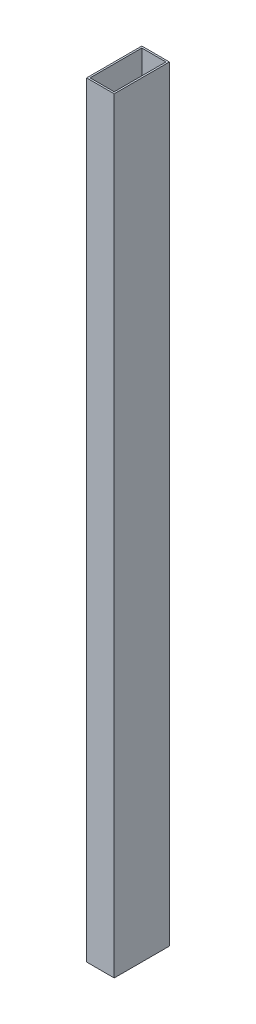
ISO-10303-21;
HEADER;
FILE_DESCRIPTION(('STEP AP214'),'2;1');
FILE_NAME('part.step','',(''),(''),'','','');
FILE_SCHEMA(('AUTOMOTIVE_DESIGN { 1 0 10303 214 1 1 1 1 }'));
ENDSEC;
DATA;
#1=APPLICATION_CONTEXT('core data for automotive mechanical design processes');
#2=APPLICATION_PROTOCOL_DEFINITION('international standard','automotive_design',2000,#1);
#3=PRODUCT_CONTEXT('',#1,'mechanical');
#4=PRODUCT('Part','Part','',(#3));
#5=PRODUCT_RELATED_PRODUCT_CATEGORY('part','',(#4));
#6=PRODUCT_DEFINITION_FORMATION('','',#4);
#7=PRODUCT_DEFINITION_CONTEXT('part definition',#1,'design');
#8=PRODUCT_DEFINITION('design','',#6,#7);
#9=PRODUCT_DEFINITION_SHAPE('','',#8);
#10=(LENGTH_UNIT() NAMED_UNIT(*) SI_UNIT(.MILLI.,.METRE.));
#11=(NAMED_UNIT(*) PLANE_ANGLE_UNIT() SI_UNIT($,.RADIAN.));
#12=(NAMED_UNIT(*) SI_UNIT($,.STERADIAN.) SOLID_ANGLE_UNIT());
#13=UNCERTAINTY_MEASURE_WITH_UNIT(LENGTH_MEASURE(1.E-05),#10,'distance_accuracy_value','');
#14=(GEOMETRIC_REPRESENTATION_CONTEXT(3) GLOBAL_UNCERTAINTY_ASSIGNED_CONTEXT((#13)) GLOBAL_UNIT_ASSIGNED_CONTEXT((#10,
#11,#12)) REPRESENTATION_CONTEXT('',''));
#15=CARTESIAN_POINT('',(0.,0.,0.));
#16=DIRECTION('',(0.,0.,1.));
#17=DIRECTION('',(1.,0.,0.));
#18=AXIS2_PLACEMENT_3D('',#15,#16,#17);
#19=CARTESIAN_POINT('',(0.,704.85,0.));
#20=DIRECTION('',(0.,1.,0.));
#21=DIRECTION('',(0.,0.,1.));
#22=AXIS2_PLACEMENT_3D('',#19,#20,#21);
#23=PLANE('',#22);
#24=DIRECTION('',(0.,0.,1.));
#25=VECTOR('',#24,1.);
#26=CARTESIAN_POINT('',(-12.7,704.85,-25.4));
#27=LINE('',#26,#25);
#28=CARTESIAN_POINT('',(-12.7,704.85,-25.4));
#29=VERTEX_POINT('',#28);
#30=CARTESIAN_POINT('',(-12.7,704.85,25.4));
#31=VERTEX_POINT('',#30);
#32=EDGE_CURVE('E176',#29,#31,#27,.T.);
#33=ORIENTED_EDGE('',*,*,#32,.T.);
#34=DIRECTION('',(1.,0.,0.));
#35=VECTOR('',#34,1.);
#36=CARTESIAN_POINT('',(12.7,704.85,25.4));
#37=LINE('',#36,#35);
#38=CARTESIAN_POINT('',(12.7,704.85,25.4));
#39=VERTEX_POINT('',#38);
#40=EDGE_CURVE('E179',#31,#39,#37,.T.);
#41=ORIENTED_EDGE('',*,*,#40,.T.);
#42=DIRECTION('',(0.,0.,-1.));
#43=VECTOR('',#42,1.);
#44=CARTESIAN_POINT('',(12.7,704.85,-25.4));
#45=LINE('',#44,#43);
#46=CARTESIAN_POINT('',(12.7,704.85,-25.4));
#47=VERTEX_POINT('',#46);
#48=EDGE_CURVE('E182',#39,#47,#45,.T.);
#49=ORIENTED_EDGE('',*,*,#48,.T.);
#50=DIRECTION('',(-1.,0.,0.));
#51=VECTOR('',#50,1.);
#52=CARTESIAN_POINT('',(12.7,704.85,-25.4));
#53=LINE('',#52,#51);
#54=EDGE_CURVE('E184',#47,#29,#53,.T.);
#55=ORIENTED_EDGE('',*,*,#54,.T.);
#56=EDGE_LOOP('',(#33,#41,#49,#55));
#57=FACE_BOUND('',#56,.T.);
#58=DIRECTION('',(1.,0.,0.));
#59=VECTOR('',#58,1.);
#60=CARTESIAN_POINT('',(0.,704.85,23.8125));
#61=LINE('',#60,#59);
#62=CARTESIAN_POINT('',(-11.1125,704.85,23.8125));
#63=VERTEX_POINT('',#62);
#64=CARTESIAN_POINT('',(11.1125,704.85,23.8125));
#65=VERTEX_POINT('',#64);
#66=EDGE_CURVE('E143',#63,#65,#61,.T.);
#67=ORIENTED_EDGE('',*,*,#66,.F.);
#68=DIRECTION('',(0.,0.,1.));
#69=VECTOR('',#68,1.);
#70=CARTESIAN_POINT('',(-11.1125,704.85,0.));
#71=LINE('',#70,#69);
#72=CARTESIAN_POINT('',(-11.1125,704.85,-23.8125));
#73=VERTEX_POINT('',#72);
#74=EDGE_CURVE('E135',#73,#63,#71,.T.);
#75=ORIENTED_EDGE('',*,*,#74,.F.);
#76=DIRECTION('',(-1.,0.,0.));
#77=VECTOR('',#76,1.);
#78=CARTESIAN_POINT('',(0.,704.85,-23.8125));
#79=LINE('',#78,#77);
#80=CARTESIAN_POINT('',(11.1125,704.85,-23.8125));
#81=VERTEX_POINT('',#80);
#82=EDGE_CURVE('E158',#81,#73,#79,.T.);
#83=ORIENTED_EDGE('',*,*,#82,.F.);
#84=DIRECTION('',(0.,0.,-1.));
#85=VECTOR('',#84,1.);
#86=CARTESIAN_POINT('',(11.1125,704.85,0.));
#87=LINE('',#86,#85);
#88=EDGE_CURVE('E156',#65,#81,#87,.T.);
#89=ORIENTED_EDGE('',*,*,#88,.F.);
#90=EDGE_LOOP('',(#67,#75,#83,#89));
#91=FACE_BOUND('',#90,.T.);
#92=ADVANCED_FACE('F69',(#57,#91),#23,.T.);
#93=CARTESIAN_POINT('',(0.,0.,0.));
#94=DIRECTION('',(0.,1.,0.));
#95=DIRECTION('',(0.,0.,1.));
#96=AXIS2_PLACEMENT_3D('',#93,#94,#95);
#97=PLANE('',#96);
#98=DIRECTION('',(0.,0.,1.));
#99=VECTOR('',#98,1.);
#100=CARTESIAN_POINT('',(-12.7,0.,-25.4));
#101=LINE('',#100,#99);
#102=CARTESIAN_POINT('',(-12.7,0.,-25.4));
#103=VERTEX_POINT('',#102);
#104=CARTESIAN_POINT('',(-12.7,0.,25.4));
#105=VERTEX_POINT('',#104);
#106=EDGE_CURVE('E152',#103,#105,#101,.T.);
#107=ORIENTED_EDGE('',*,*,#106,.F.);
#108=DIRECTION('',(-1.,0.,0.));
#109=VECTOR('',#108,1.);
#110=CARTESIAN_POINT('',(12.7,0.,-25.4));
#111=LINE('',#110,#109);
#112=CARTESIAN_POINT('',(12.7,0.,-25.4));
#113=VERTEX_POINT('',#112);
#114=EDGE_CURVE('E180',#113,#103,#111,.T.);
#115=ORIENTED_EDGE('',*,*,#114,.F.);
#116=DIRECTION('',(0.,0.,-1.));
#117=VECTOR('',#116,1.);
#118=CARTESIAN_POINT('',(12.7,0.,-25.4));
#119=LINE('',#118,#117);
#120=CARTESIAN_POINT('',(12.7,0.,25.4));
#121=VERTEX_POINT('',#120);
#122=EDGE_CURVE('E192',#121,#113,#119,.T.);
#123=ORIENTED_EDGE('',*,*,#122,.F.);
#124=DIRECTION('',(1.,0.,0.));
#125=VECTOR('',#124,1.);
#126=CARTESIAN_POINT('',(12.7,0.,25.4));
#127=LINE('',#126,#125);
#128=EDGE_CURVE('E190',#105,#121,#127,.T.);
#129=ORIENTED_EDGE('',*,*,#128,.F.);
#130=EDGE_LOOP('',(#107,#115,#123,#129));
#131=FACE_BOUND('',#130,.T.);
#132=DIRECTION('',(0.,0.,1.));
#133=VECTOR('',#132,1.);
#134=CARTESIAN_POINT('',(-11.1125,0.,0.));
#135=LINE('',#134,#133);
#136=CARTESIAN_POINT('',(-11.1125,0.,-23.8125));
#137=VERTEX_POINT('',#136);
#138=CARTESIAN_POINT('',(-11.1125,0.,23.8125));
#139=VERTEX_POINT('',#138);
#140=EDGE_CURVE('E93',#137,#139,#135,.T.);
#141=ORIENTED_EDGE('',*,*,#140,.T.);
#142=DIRECTION('',(1.,0.,0.));
#143=VECTOR('',#142,1.);
#144=CARTESIAN_POINT('',(0.,0.,23.8125));
#145=LINE('',#144,#143);
#146=CARTESIAN_POINT('',(11.1125,0.,23.8125));
#147=VERTEX_POINT('',#146);
#148=EDGE_CURVE('E150',#139,#147,#145,.T.);
#149=ORIENTED_EDGE('',*,*,#148,.T.);
#150=DIRECTION('',(0.,0.,-1.));
#151=VECTOR('',#150,1.);
#152=CARTESIAN_POINT('',(11.1125,0.,0.));
#153=LINE('',#152,#151);
#154=CARTESIAN_POINT('',(11.1125,0.,-23.8125));
#155=VERTEX_POINT('',#154);
#156=EDGE_CURVE('E165',#147,#155,#153,.T.);
#157=ORIENTED_EDGE('',*,*,#156,.T.);
#158=DIRECTION('',(-1.,0.,0.));
#159=VECTOR('',#158,1.);
#160=CARTESIAN_POINT('',(0.,0.,-23.8125));
#161=LINE('',#160,#159);
#162=EDGE_CURVE('E144',#155,#137,#161,.T.);
#163=ORIENTED_EDGE('',*,*,#162,.T.);
#164=EDGE_LOOP('',(#141,#149,#157,#163));
#165=FACE_BOUND('',#164,.T.);
#166=ADVANCED_FACE('F213',(#131,#165),#97,.F.);
#167=CARTESIAN_POINT('',(-12.7,704.85,-25.4));
#168=DIRECTION('',(1.,0.,0.));
#169=DIRECTION('',(0.,0.,-1.));
#170=AXIS2_PLACEMENT_3D('',#167,#168,#169);
#171=PLANE('',#170);
#172=ORIENTED_EDGE('',*,*,#106,.T.);
#173=DIRECTION('',(0.,-1.,0.));
#174=VECTOR('',#173,1.);
#175=CARTESIAN_POINT('',(-12.7,704.85,25.4));
#176=LINE('',#175,#174);
#177=EDGE_CURVE('E12',#31,#105,#176,.T.);
#178=ORIENTED_EDGE('',*,*,#177,.F.);
#179=ORIENTED_EDGE('',*,*,#32,.F.);
#180=DIRECTION('',(0.,-1.,0.));
#181=VECTOR('',#180,1.);
#182=CARTESIAN_POINT('',(-12.7,704.85,-25.4));
#183=LINE('',#182,#181);
#184=EDGE_CURVE('E186',#29,#103,#183,.T.);
#185=ORIENTED_EDGE('',*,*,#184,.T.);
#186=EDGE_LOOP('',(#172,#178,#179,#185));
#187=FACE_BOUND('',#186,.T.);
#188=ADVANCED_FACE('F71',(#187),#171,.F.);
#189=CARTESIAN_POINT('',(12.7,704.85,25.4));
#190=DIRECTION('',(0.,0.,-1.));
#191=DIRECTION('',(-1.,0.,0.));
#192=AXIS2_PLACEMENT_3D('',#189,#190,#191);
#193=PLANE('',#192);
#194=ORIENTED_EDGE('',*,*,#128,.T.);
#195=DIRECTION('',(0.,-1.,0.));
#196=VECTOR('',#195,1.);
#197=CARTESIAN_POINT('',(12.7,704.85,25.4));
#198=LINE('',#197,#196);
#199=EDGE_CURVE('E78',#39,#121,#198,.T.);
#200=ORIENTED_EDGE('',*,*,#199,.F.);
#201=ORIENTED_EDGE('',*,*,#40,.F.);
#202=ORIENTED_EDGE('',*,*,#177,.T.);
#203=EDGE_LOOP('',(#194,#200,#201,#202));
#204=FACE_BOUND('',#203,.T.);
#205=ADVANCED_FACE('F223',(#204),#193,.F.);
#206=CARTESIAN_POINT('',(12.7,704.85,-25.4));
#207=DIRECTION('',(-1.,0.,0.));
#208=DIRECTION('',(0.,0.,1.));
#209=AXIS2_PLACEMENT_3D('',#206,#207,#208);
#210=PLANE('',#209);
#211=ORIENTED_EDGE('',*,*,#122,.T.);
#212=DIRECTION('',(0.,-1.,0.));
#213=VECTOR('',#212,1.);
#214=CARTESIAN_POINT('',(12.7,704.85,-25.4));
#215=LINE('',#214,#213);
#216=EDGE_CURVE('E198',#47,#113,#215,.T.);
#217=ORIENTED_EDGE('',*,*,#216,.F.);
#218=ORIENTED_EDGE('',*,*,#48,.F.);
#219=ORIENTED_EDGE('',*,*,#199,.T.);
#220=EDGE_LOOP('',(#211,#217,#218,#219));
#221=FACE_BOUND('',#220,.T.);
#222=ADVANCED_FACE('F207',(#221),#210,.F.);
#223=CARTESIAN_POINT('',(12.7,704.85,-25.4));
#224=DIRECTION('',(0.,0.,1.));
#225=DIRECTION('',(1.,0.,0.));
#226=AXIS2_PLACEMENT_3D('',#223,#224,#225);
#227=PLANE('',#226);
#228=ORIENTED_EDGE('',*,*,#114,.T.);
#229=ORIENTED_EDGE('',*,*,#184,.F.);
#230=ORIENTED_EDGE('',*,*,#54,.F.);
#231=ORIENTED_EDGE('',*,*,#216,.T.);
#232=EDGE_LOOP('',(#228,#229,#230,#231));
#233=FACE_BOUND('',#232,.T.);
#234=ADVANCED_FACE('F217',(#233),#227,.F.);
#235=CARTESIAN_POINT('',(-11.1125,704.85,0.));
#236=DIRECTION('',(1.,0.,0.));
#237=DIRECTION('',(0.,0.,-1.));
#238=AXIS2_PLACEMENT_3D('',#235,#236,#237);
#239=PLANE('',#238);
#240=ORIENTED_EDGE('',*,*,#140,.F.);
#241=DIRECTION('',(0.,-1.,0.));
#242=VECTOR('',#241,1.);
#243=CARTESIAN_POINT('',(-11.1125,704.85,-23.8125));
#244=LINE('',#243,#242);
#245=EDGE_CURVE('E139',#73,#137,#244,.T.);
#246=ORIENTED_EDGE('',*,*,#245,.F.);
#247=ORIENTED_EDGE('',*,*,#74,.T.);
#248=DIRECTION('',(0.,-1.,0.));
#249=VECTOR('',#248,1.);
#250=CARTESIAN_POINT('',(-11.1125,704.85,23.8125));
#251=LINE('',#250,#249);
#252=EDGE_CURVE('E138',#63,#139,#251,.T.);
#253=ORIENTED_EDGE('',*,*,#252,.T.);
#254=EDGE_LOOP('',(#240,#246,#247,#253));
#255=FACE_BOUND('',#254,.T.);
#256=ADVANCED_FACE('F137',(#255),#239,.T.);
#257=CARTESIAN_POINT('',(0.,704.85,23.8125));
#258=DIRECTION('',(0.,0.,-1.));
#259=DIRECTION('',(-1.,0.,0.));
#260=AXIS2_PLACEMENT_3D('',#257,#258,#259);
#261=PLANE('',#260);
#262=ORIENTED_EDGE('',*,*,#148,.F.);
#263=ORIENTED_EDGE('',*,*,#252,.F.);
#264=ORIENTED_EDGE('',*,*,#66,.T.);
#265=DIRECTION('',(0.,-1.,0.));
#266=VECTOR('',#265,1.);
#267=CARTESIAN_POINT('',(11.1125,704.85,23.8125));
#268=LINE('',#267,#266);
#269=EDGE_CURVE('E153',#65,#147,#268,.T.);
#270=ORIENTED_EDGE('',*,*,#269,.T.);
#271=EDGE_LOOP('',(#262,#263,#264,#270));
#272=FACE_BOUND('',#271,.T.);
#273=ADVANCED_FACE('F147',(#272),#261,.T.);
#274=CARTESIAN_POINT('',(11.1125,704.85,0.));
#275=DIRECTION('',(-1.,0.,0.));
#276=DIRECTION('',(0.,0.,1.));
#277=AXIS2_PLACEMENT_3D('',#274,#275,#276);
#278=PLANE('',#277);
#279=ORIENTED_EDGE('',*,*,#156,.F.);
#280=ORIENTED_EDGE('',*,*,#269,.F.);
#281=ORIENTED_EDGE('',*,*,#88,.T.);
#282=DIRECTION('',(0.,-1.,0.));
#283=VECTOR('',#282,1.);
#284=CARTESIAN_POINT('',(11.1125,704.85,-23.8125));
#285=LINE('',#284,#283);
#286=EDGE_CURVE('E85',#81,#155,#285,.T.);
#287=ORIENTED_EDGE('',*,*,#286,.T.);
#288=EDGE_LOOP('',(#279,#280,#281,#287));
#289=FACE_BOUND('',#288,.T.);
#290=ADVANCED_FACE('F248',(#289),#278,.T.);
#291=CARTESIAN_POINT('',(0.,704.85,-23.8125));
#292=DIRECTION('',(0.,0.,1.));
#293=DIRECTION('',(1.,0.,0.));
#294=AXIS2_PLACEMENT_3D('',#291,#292,#293);
#295=PLANE('',#294);
#296=ORIENTED_EDGE('',*,*,#162,.F.);
#297=ORIENTED_EDGE('',*,*,#286,.F.);
#298=ORIENTED_EDGE('',*,*,#82,.T.);
#299=ORIENTED_EDGE('',*,*,#245,.T.);
#300=EDGE_LOOP('',(#296,#297,#298,#299));
#301=FACE_BOUND('',#300,.T.);
#302=ADVANCED_FACE('F251',(#301),#295,.T.);
#303=CLOSED_SHELL('',(#92,#166,#188,#205,#222,#234,#256,#273,#290,#302));
#304=MANIFOLD_SOLID_BREP('B2',#303);
#305=ADVANCED_BREP_SHAPE_REPRESENTATION('',(#18,#304),#14);
#306=SHAPE_DEFINITION_REPRESENTATION(#9,#305);
ENDSEC;
END-ISO-10303-21;
